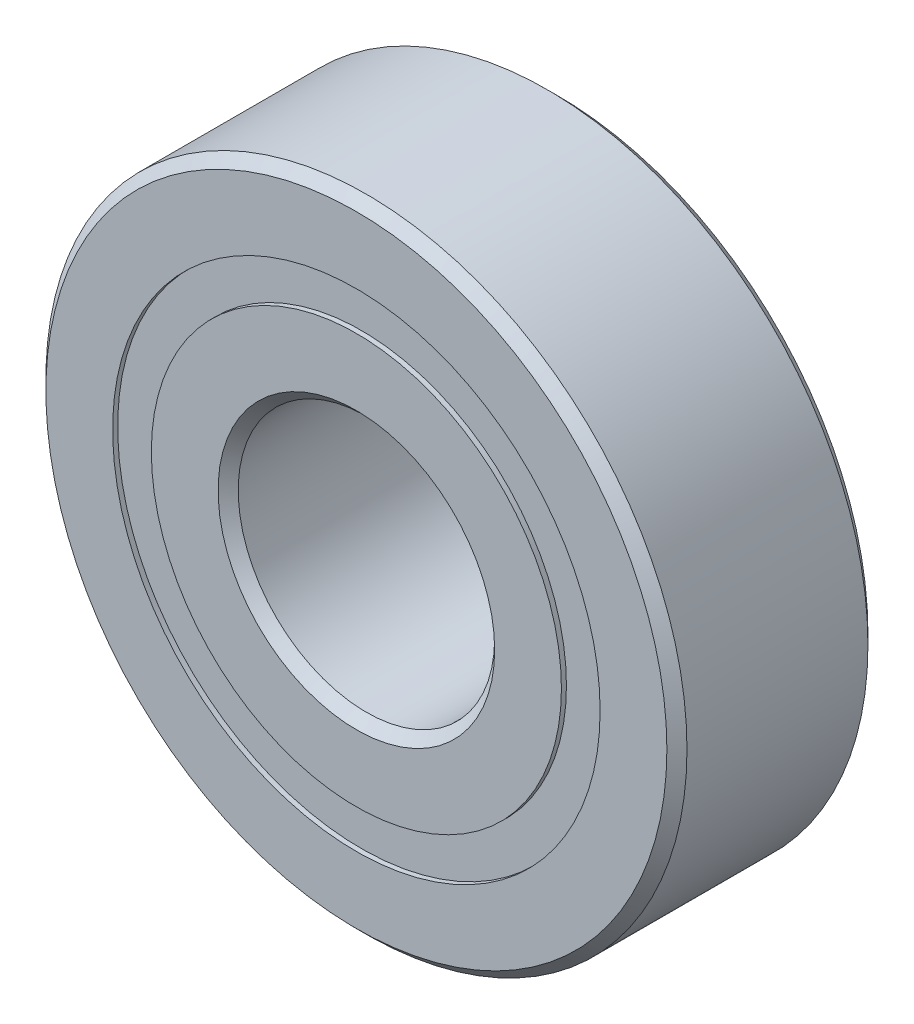
ISO-10303-21;
HEADER;
FILE_DESCRIPTION(('STEP AP214'),'2;1');
FILE_NAME('part.step','',(''),(''),'','','');
FILE_SCHEMA(('AUTOMOTIVE_DESIGN { 1 0 10303 214 1 1 1 1 }'));
ENDSEC;
DATA;
#1=APPLICATION_CONTEXT('core data for automotive mechanical design processes');
#2=APPLICATION_PROTOCOL_DEFINITION('international standard','automotive_design',2000,#1);
#3=PRODUCT_CONTEXT('',#1,'mechanical');
#4=PRODUCT('Part','Part','',(#3));
#5=PRODUCT_RELATED_PRODUCT_CATEGORY('part','',(#4));
#6=PRODUCT_DEFINITION_FORMATION('','',#4);
#7=PRODUCT_DEFINITION_CONTEXT('part definition',#1,'design');
#8=PRODUCT_DEFINITION('design','',#6,#7);
#9=PRODUCT_DEFINITION_SHAPE('','',#8);
#10=(LENGTH_UNIT() NAMED_UNIT(*) SI_UNIT(.MILLI.,.METRE.));
#11=(NAMED_UNIT(*) PLANE_ANGLE_UNIT() SI_UNIT($,.RADIAN.));
#12=(NAMED_UNIT(*) SI_UNIT($,.STERADIAN.) SOLID_ANGLE_UNIT());
#13=UNCERTAINTY_MEASURE_WITH_UNIT(LENGTH_MEASURE(1.E-05),#10,'distance_accuracy_value','');
#14=(GEOMETRIC_REPRESENTATION_CONTEXT(3) GLOBAL_UNCERTAINTY_ASSIGNED_CONTEXT((#13)) GLOBAL_UNIT_ASSIGNED_CONTEXT((#10,
#11,#12)) REPRESENTATION_CONTEXT('',''));
#15=CARTESIAN_POINT('',(0.,0.,0.));
#16=DIRECTION('',(0.,0.,1.));
#17=DIRECTION('',(1.,0.,0.));
#18=AXIS2_PLACEMENT_3D('',#15,#16,#17);
#19=CARTESIAN_POINT('',(0.,6.03522142857143,-2.36474));
#20=DIRECTION('',(0.,0.,1.));
#21=DIRECTION('',(1.,0.,0.));
#22=AXIS2_PLACEMENT_3D('',#19,#20,#21);
#23=PLANE('',#22);
#24=CARTESIAN_POINT('',(0.,0.,-2.36474));
#25=DIRECTION('',(0.,0.,1.));
#26=DIRECTION('',(1.,0.,0.));
#27=AXIS2_PLACEMENT_3D('',#24,#25,#26);
#28=CIRCLE('',#27,6.03522142857143);
#29=CARTESIAN_POINT('',(6.03522142857143,0.,-2.36474));
#30=VERTEX_POINT('',#29);
#31=EDGE_CURVE('E55',#30,#30,#28,.T.);
#32=ORIENTED_EDGE('',*,*,#31,.F.);
#33=EDGE_LOOP('',(#32));
#34=FACE_BOUND('',#33,.T.);
#35=CARTESIAN_POINT('',(0.,0.,-2.36474));
#36=DIRECTION('',(0.,0.,1.));
#37=DIRECTION('',(1.,0.,0.));
#38=AXIS2_PLACEMENT_3D('',#35,#36,#37);
#39=CIRCLE('',#38,5.07727857142857);
#40=CARTESIAN_POINT('',(5.07727857142857,0.,-2.36474));
#41=VERTEX_POINT('',#40);
#42=EDGE_CURVE('E11',#41,#41,#39,.T.);
#43=ORIENTED_EDGE('',*,*,#42,.T.);
#44=EDGE_LOOP('',(#43));
#45=FACE_BOUND('',#44,.T.);
#46=ADVANCED_FACE('F41',(#34,#45),#23,.F.);
#47=CARTESIAN_POINT('',(0.,0.,2.4892));
#48=DIRECTION('',(0.,0.,1.));
#49=DIRECTION('',(1.,0.,0.));
#50=AXIS2_PLACEMENT_3D('',#47,#48,#49);
#51=CYLINDRICAL_SURFACE('',#50,5.07727857142857);
#52=ORIENTED_EDGE('',*,*,#42,.F.);
#53=EDGE_LOOP('',(#52));
#54=FACE_BOUND('',#53,.T.);
#55=CARTESIAN_POINT('',(0.,0.,-1.20554465033679));
#56=DIRECTION('',(0.,0.,1.));
#57=DIRECTION('',(1.,0.,0.));
#58=AXIS2_PLACEMENT_3D('',#55,#56,#57);
#59=CIRCLE('',#58,5.07727857142857);
#60=CARTESIAN_POINT('',(5.07727857142857,0.,-1.20554465033679));
#61=VERTEX_POINT('',#60);
#62=EDGE_CURVE('E47',#61,#61,#59,.T.);
#63=ORIENTED_EDGE('',*,*,#62,.T.);
#64=EDGE_LOOP('',(#63));
#65=FACE_BOUND('',#64,.T.);
#66=ADVANCED_FACE('F64',(#54,#65),#51,.F.);
#67=CARTESIAN_POINT('',(0.,6.03522142857143,-1.20554465033679));
#68=DIRECTION('',(0.,0.,-1.));
#69=DIRECTION('',(-1.,0.,0.));
#70=AXIS2_PLACEMENT_3D('',#67,#68,#69);
#71=PLANE('',#70);
#72=ORIENTED_EDGE('',*,*,#62,.F.);
#73=EDGE_LOOP('',(#72));
#74=FACE_BOUND('',#73,.T.);
#75=CARTESIAN_POINT('',(0.,0.,-1.20554465033679));
#76=DIRECTION('',(0.,0.,1.));
#77=DIRECTION('',(1.,0.,0.));
#78=AXIS2_PLACEMENT_3D('',#75,#76,#77);
#79=CIRCLE('',#78,6.03522142857143);
#80=CARTESIAN_POINT('',(6.03522142857143,0.,-1.20554465033679));
#81=VERTEX_POINT('',#80);
#82=EDGE_CURVE('E51',#81,#81,#79,.T.);
#83=ORIENTED_EDGE('',*,*,#82,.T.);
#84=EDGE_LOOP('',(#83));
#85=FACE_BOUND('',#84,.T.);
#86=ADVANCED_FACE('F68',(#74,#85),#71,.F.);
#87=CARTESIAN_POINT('',(0.,0.,2.4892));
#88=DIRECTION('',(0.,0.,1.));
#89=DIRECTION('',(1.,0.,0.));
#90=AXIS2_PLACEMENT_3D('',#87,#88,#89);
#91=CYLINDRICAL_SURFACE('',#90,6.03522142857143);
#92=ORIENTED_EDGE('',*,*,#82,.F.);
#93=EDGE_LOOP('',(#92));
#94=FACE_BOUND('',#93,.T.);
#95=ORIENTED_EDGE('',*,*,#31,.T.);
#96=EDGE_LOOP('',(#95));
#97=FACE_BOUND('',#96,.T.);
#98=ADVANCED_FACE('F61',(#94,#97),#91,.T.);
#99=CLOSED_SHELL('',(#46,#66,#86,#98));
#100=MANIFOLD_SOLID_BREP('B2',#99);
#101=CARTESIAN_POINT('',(0.,6.03522142857143,2.36474));
#102=DIRECTION('',(0.,0.,-1.));
#103=DIRECTION('',(-1.,0.,0.));
#104=AXIS2_PLACEMENT_3D('',#101,#102,#103);
#105=PLANE('',#104);
#106=CARTESIAN_POINT('',(0.,0.,2.36474));
#107=DIRECTION('',(0.,0.,1.));
#108=DIRECTION('',(1.,0.,0.));
#109=AXIS2_PLACEMENT_3D('',#106,#107,#108);
#110=CIRCLE('',#109,5.07727857142857);
#111=CARTESIAN_POINT('',(5.07727857142857,0.,2.36474));
#112=VERTEX_POINT('',#111);
#113=EDGE_CURVE('E40',#112,#112,#110,.T.);
#114=ORIENTED_EDGE('',*,*,#113,.F.);
#115=EDGE_LOOP('',(#114));
#116=FACE_BOUND('',#115,.T.);
#117=CARTESIAN_POINT('',(0.,0.,2.36474));
#118=DIRECTION('',(0.,0.,1.));
#119=DIRECTION('',(1.,0.,0.));
#120=AXIS2_PLACEMENT_3D('',#117,#118,#119);
#121=CIRCLE('',#120,6.03522142857143);
#122=CARTESIAN_POINT('',(6.03522142857143,0.,2.36474));
#123=VERTEX_POINT('',#122);
#124=EDGE_CURVE('E122',#123,#123,#121,.T.);
#125=ORIENTED_EDGE('',*,*,#124,.T.);
#126=EDGE_LOOP('',(#125));
#127=FACE_BOUND('',#126,.T.);
#128=ADVANCED_FACE('F108',(#116,#127),#105,.F.);
#129=CARTESIAN_POINT('',(0.,0.,2.4892));
#130=DIRECTION('',(0.,0.,1.));
#131=DIRECTION('',(1.,0.,0.));
#132=AXIS2_PLACEMENT_3D('',#129,#130,#131);
#133=CYLINDRICAL_SURFACE('',#132,5.07727857142857);
#134=CARTESIAN_POINT('',(0.,0.,1.20554465033679));
#135=DIRECTION('',(0.,0.,1.));
#136=DIRECTION('',(1.,0.,0.));
#137=AXIS2_PLACEMENT_3D('',#134,#135,#136);
#138=CIRCLE('',#137,5.07727857142857);
#139=CARTESIAN_POINT('',(5.07727857142857,0.,1.20554465033679));
#140=VERTEX_POINT('',#139);
#141=EDGE_CURVE('E114',#140,#140,#138,.T.);
#142=ORIENTED_EDGE('',*,*,#141,.F.);
#143=EDGE_LOOP('',(#142));
#144=FACE_BOUND('',#143,.T.);
#145=ORIENTED_EDGE('',*,*,#113,.T.);
#146=EDGE_LOOP('',(#145));
#147=FACE_BOUND('',#146,.T.);
#148=ADVANCED_FACE('F137',(#144,#147),#133,.F.);
#149=CARTESIAN_POINT('',(0.,6.03522142857143,1.20554465033679));
#150=DIRECTION('',(0.,0.,1.));
#151=DIRECTION('',(1.,0.,0.));
#152=AXIS2_PLACEMENT_3D('',#149,#150,#151);
#153=PLANE('',#152);
#154=CARTESIAN_POINT('',(0.,0.,1.20554465033679));
#155=DIRECTION('',(0.,0.,1.));
#156=DIRECTION('',(1.,0.,0.));
#157=AXIS2_PLACEMENT_3D('',#154,#155,#156);
#158=CIRCLE('',#157,6.03522142857143);
#159=CARTESIAN_POINT('',(6.03522142857143,0.,1.20554465033679));
#160=VERTEX_POINT('',#159);
#161=EDGE_CURVE('E118',#160,#160,#158,.T.);
#162=ORIENTED_EDGE('',*,*,#161,.F.);
#163=EDGE_LOOP('',(#162));
#164=FACE_BOUND('',#163,.T.);
#165=ORIENTED_EDGE('',*,*,#141,.T.);
#166=EDGE_LOOP('',(#165));
#167=FACE_BOUND('',#166,.T.);
#168=ADVANCED_FACE('F132',(#164,#167),#153,.F.);
#169=CARTESIAN_POINT('',(0.,0.,2.4892));
#170=DIRECTION('',(0.,0.,1.));
#171=DIRECTION('',(1.,0.,0.));
#172=AXIS2_PLACEMENT_3D('',#169,#170,#171);
#173=CYLINDRICAL_SURFACE('',#172,6.03522142857143);
#174=ORIENTED_EDGE('',*,*,#124,.F.);
#175=EDGE_LOOP('',(#174));
#176=FACE_BOUND('',#175,.T.);
#177=ORIENTED_EDGE('',*,*,#161,.T.);
#178=EDGE_LOOP('',(#177));
#179=FACE_BOUND('',#178,.T.);
#180=ADVANCED_FACE('F129',(#176,#179),#173,.T.);
#181=CLOSED_SHELL('',(#128,#148,#168,#180));
#182=MANIFOLD_SOLID_BREP('B6',#181);
#183=CARTESIAN_POINT('',(-3.92886205296771,3.9288620529678,0.));
#184=DIRECTION('',(0.,0.,1.));
#185=DIRECTION('',(-0.707106781186539,0.707106781186556,0.));
#186=AXIS2_PLACEMENT_3D('',#183,#184,#185);
#187=SPHERICAL_SURFACE('',#186,1.20554465033679);
#188=CARTESIAN_POINT('',(-3.92886205296771,3.9288620529678,1.20554465033679));
#189=VERTEX_POINT('',#188);
#190=VERTEX_LOOP('',#189);
#191=FACE_BOUND('',#190,.T.);
#192=ADVANCED_FACE('F175',(#191),#187,.T.);
#193=CLOSED_SHELL('',(#192));
#194=MANIFOLD_SOLID_BREP('B35',#193);
#195=CARTESIAN_POINT('',(-5.55625,0.,0.));
#196=DIRECTION('',(0.,0.,1.));
#197=DIRECTION('',(-1.,0.,0.));
#198=AXIS2_PLACEMENT_3D('',#195,#196,#197);
#199=SPHERICAL_SURFACE('',#198,1.20554465033679);
#200=CARTESIAN_POINT('',(-5.55625,0.,1.20554465033679));
#201=VERTEX_POINT('',#200);
#202=VERTEX_LOOP('',#201);
#203=FACE_BOUND('',#202,.T.);
#204=ADVANCED_FACE('F195',(#203),#199,.T.);
#205=CLOSED_SHELL('',(#204));
#206=MANIFOLD_SOLID_BREP('B104',#205);
#207=CARTESIAN_POINT('',(-3.92886205296779,-3.92886205296772,0.));
#208=DIRECTION('',(0.,0.,1.));
#209=DIRECTION('',(-0.707106781186554,-0.707106781186541,0.));
#210=AXIS2_PLACEMENT_3D('',#207,#208,#209);
#211=SPHERICAL_SURFACE('',#210,1.20554465033679);
#212=CARTESIAN_POINT('',(-3.92886205296779,-3.92886205296772,1.20554465033679));
#213=VERTEX_POINT('',#212);
#214=VERTEX_LOOP('',#213);
#215=FACE_BOUND('',#214,.T.);
#216=ADVANCED_FACE('F215',(#215),#211,.T.);
#217=CLOSED_SHELL('',(#216));
#218=MANIFOLD_SOLID_BREP('B171',#217);
#219=CARTESIAN_POINT('',(0.,-5.55625,0.));
#220=DIRECTION('',(0.,0.,1.));
#221=DIRECTION('',(0.,-1.,0.));
#222=AXIS2_PLACEMENT_3D('',#219,#220,#221);
#223=SPHERICAL_SURFACE('',#222,1.20554465033679);
#224=CARTESIAN_POINT('',(0.,-5.55625,1.20554465033679));
#225=VERTEX_POINT('',#224);
#226=VERTEX_LOOP('',#225);
#227=FACE_BOUND('',#226,.T.);
#228=ADVANCED_FACE('F235',(#227),#223,.T.);
#229=CLOSED_SHELL('',(#228));
#230=MANIFOLD_SOLID_BREP('B191',#229);
#231=CARTESIAN_POINT('',(3.92886205296773,-3.92886205296778,0.));
#232=DIRECTION('',(0.,0.,1.));
#233=DIRECTION('',(0.707106781186544,-0.707106781186551,0.));
#234=AXIS2_PLACEMENT_3D('',#231,#232,#233);
#235=SPHERICAL_SURFACE('',#234,1.20554465033679);
#236=CARTESIAN_POINT('',(3.92886205296773,-3.92886205296778,1.20554465033679));
#237=VERTEX_POINT('',#236);
#238=VERTEX_LOOP('',#237);
#239=FACE_BOUND('',#238,.T.);
#240=ADVANCED_FACE('F255',(#239),#235,.T.);
#241=CLOSED_SHELL('',(#240));
#242=MANIFOLD_SOLID_BREP('B211',#241);
#243=CARTESIAN_POINT('',(5.55625,0.,0.));
#244=DIRECTION('',(0.,0.,1.));
#245=DIRECTION('',(1.,0.,0.));
#246=AXIS2_PLACEMENT_3D('',#243,#244,#245);
#247=SPHERICAL_SURFACE('',#246,1.20554465033679);
#248=CARTESIAN_POINT('',(5.55625,0.,1.20554465033679));
#249=VERTEX_POINT('',#248);
#250=VERTEX_LOOP('',#249);
#251=FACE_BOUND('',#250,.T.);
#252=ADVANCED_FACE('F275',(#251),#247,.T.);
#253=CLOSED_SHELL('',(#252));
#254=MANIFOLD_SOLID_BREP('B231',#253);
#255=CARTESIAN_POINT('',(3.92886205296776,3.92886205296775,0.));
#256=DIRECTION('',(0.,0.,1.));
#257=DIRECTION('',(0.707106781186549,0.707106781186546,0.));
#258=AXIS2_PLACEMENT_3D('',#255,#256,#257);
#259=SPHERICAL_SURFACE('',#258,1.20554465033679);
#260=CARTESIAN_POINT('',(3.92886205296776,3.92886205296775,1.20554465033679));
#261=VERTEX_POINT('',#260);
#262=VERTEX_LOOP('',#261);
#263=FACE_BOUND('',#262,.T.);
#264=ADVANCED_FACE('F295',(#263),#259,.T.);
#265=CLOSED_SHELL('',(#264));
#266=MANIFOLD_SOLID_BREP('B251',#265);
#267=CARTESIAN_POINT('',(0.,5.55625,0.));
#268=DIRECTION('',(0.,0.,1.));
#269=DIRECTION('',(0.,1.,0.));
#270=AXIS2_PLACEMENT_3D('',#267,#268,#269);
#271=SPHERICAL_SURFACE('',#270,1.20554465033679);
#272=CARTESIAN_POINT('',(0.,5.55625,1.20554465033679));
#273=VERTEX_POINT('',#272);
#274=VERTEX_LOOP('',#273);
#275=FACE_BOUND('',#274,.T.);
#276=ADVANCED_FACE('F317',(#275),#271,.T.);
#277=CLOSED_SHELL('',(#276));
#278=MANIFOLD_SOLID_BREP('B271',#277);
#279=CARTESIAN_POINT('',(0.,5.07727857142857,2.4892));
#280=DIRECTION('',(0.,0.,-1.));
#281=DIRECTION('',(-1.,0.,0.));
#282=AXIS2_PLACEMENT_3D('',#279,#280,#281);
#283=PLANE('',#282);
#284=CARTESIAN_POINT('',(0.,0.,2.4892));
#285=DIRECTION('',(0.,0.,1.));
#286=DIRECTION('',(1.,0.,0.));
#287=AXIS2_PLACEMENT_3D('',#284,#285,#286);
#288=CIRCLE('',#287,3.42392);
#289=CARTESIAN_POINT('',(3.42392,0.,2.4892));
#290=VERTEX_POINT('',#289);
#291=EDGE_CURVE('E364',#290,#290,#288,.T.);
#292=ORIENTED_EDGE('',*,*,#291,.F.);
#293=EDGE_LOOP('',(#292));
#294=FACE_BOUND('',#293,.T.);
#295=CARTESIAN_POINT('',(0.,0.,2.4892));
#296=DIRECTION('',(0.,0.,1.));
#297=DIRECTION('',(1.,0.,0.));
#298=AXIS2_PLACEMENT_3D('',#295,#296,#297);
#299=CIRCLE('',#298,5.07727857142857);
#300=CARTESIAN_POINT('',(5.07727857142857,0.,2.4892));
#301=VERTEX_POINT('',#300);
#302=EDGE_CURVE('E316',#301,#301,#299,.T.);
#303=ORIENTED_EDGE('',*,*,#302,.T.);
#304=EDGE_LOOP('',(#303));
#305=FACE_BOUND('',#304,.T.);
#306=ADVANCED_FACE('F336',(#294,#305),#283,.F.);
#307=CARTESIAN_POINT('',(0.,0.,2.4892));
#308=DIRECTION('',(0.,0.,1.));
#309=DIRECTION('',(1.,0.,0.));
#310=AXIS2_PLACEMENT_3D('',#307,#308,#309);
#311=CYLINDRICAL_SURFACE('',#310,5.07727857142857);
#312=ORIENTED_EDGE('',*,*,#302,.F.);
#313=EDGE_LOOP('',(#312));
#314=FACE_BOUND('',#313,.T.);
#315=CARTESIAN_POINT('',(0.,0.,1.10631111111111));
#316=DIRECTION('',(0.,0.,1.));
#317=DIRECTION('',(1.,0.,0.));
#318=AXIS2_PLACEMENT_3D('',#315,#316,#317);
#319=CIRCLE('',#318,5.07727857142857);
#320=CARTESIAN_POINT('',(5.07727857142857,0.,1.10631111111111));
#321=VERTEX_POINT('',#320);
#322=EDGE_CURVE('E342',#321,#321,#319,.T.);
#323=ORIENTED_EDGE('',*,*,#322,.T.);
#324=EDGE_LOOP('',(#323));
#325=FACE_BOUND('',#324,.T.);
#326=ADVANCED_FACE('F371',(#314,#325),#311,.T.);
#327=CARTESIAN_POINT('',(0.,0.,0.));
#328=DIRECTION('',(0.,0.,1.));
#329=DIRECTION('',(1.,0.,0.));
#330=AXIS2_PLACEMENT_3D('',#327,#328,#329);
#331=TOROIDAL_SURFACE('',#330,5.55625,1.20554465033679);
#332=ORIENTED_EDGE('',*,*,#322,.F.);
#333=EDGE_LOOP('',(#332));
#334=FACE_BOUND('',#333,.T.);
#335=CARTESIAN_POINT('',(0.,0.,-1.10631111111111));
#336=DIRECTION('',(0.,0.,1.));
#337=DIRECTION('',(1.,0.,0.));
#338=AXIS2_PLACEMENT_3D('',#335,#336,#337);
#339=CIRCLE('',#338,5.07727857142857);
#340=CARTESIAN_POINT('',(5.07727857142857,0.,-1.10631111111111));
#341=VERTEX_POINT('',#340);
#342=EDGE_CURVE('E346',#341,#341,#339,.T.);
#343=ORIENTED_EDGE('',*,*,#342,.T.);
#344=EDGE_LOOP('',(#343));
#345=FACE_BOUND('',#344,.T.);
#346=ADVANCED_FACE('F375',(#334,#345),#331,.F.);
#347=CARTESIAN_POINT('',(0.,0.,2.4892));
#348=DIRECTION('',(0.,0.,1.));
#349=DIRECTION('',(1.,0.,0.));
#350=AXIS2_PLACEMENT_3D('',#347,#348,#349);
#351=CYLINDRICAL_SURFACE('',#350,5.07727857142857);
#352=ORIENTED_EDGE('',*,*,#342,.F.);
#353=EDGE_LOOP('',(#352));
#354=FACE_BOUND('',#353,.T.);
#355=CARTESIAN_POINT('',(0.,0.,-2.4892));
#356=DIRECTION('',(0.,0.,1.));
#357=DIRECTION('',(1.,0.,0.));
#358=AXIS2_PLACEMENT_3D('',#355,#356,#357);
#359=CIRCLE('',#358,5.07727857142857);
#360=CARTESIAN_POINT('',(5.07727857142857,0.,-2.4892));
#361=VERTEX_POINT('',#360);
#362=EDGE_CURVE('E350',#361,#361,#359,.T.);
#363=ORIENTED_EDGE('',*,*,#362,.T.);
#364=EDGE_LOOP('',(#363));
#365=FACE_BOUND('',#364,.T.);
#366=ADVANCED_FACE('F380',(#354,#365),#351,.T.);
#367=CARTESIAN_POINT('',(0.,3.42392,-2.4892));
#368=DIRECTION('',(0.,0.,1.));
#369=DIRECTION('',(1.,0.,0.));
#370=AXIS2_PLACEMENT_3D('',#367,#368,#369);
#371=PLANE('',#370);
#372=ORIENTED_EDGE('',*,*,#362,.F.);
#373=EDGE_LOOP('',(#372));
#374=FACE_BOUND('',#373,.T.);
#375=CARTESIAN_POINT('',(0.,0.,-2.4892));
#376=DIRECTION('',(0.,0.,1.));
#377=DIRECTION('',(1.,0.,0.));
#378=AXIS2_PLACEMENT_3D('',#375,#376,#377);
#379=CIRCLE('',#378,3.42392);
#380=CARTESIAN_POINT('',(3.42392,0.,-2.4892));
#381=VERTEX_POINT('',#380);
#382=EDGE_CURVE('E355',#381,#381,#379,.T.);
#383=ORIENTED_EDGE('',*,*,#382,.T.);
#384=EDGE_LOOP('',(#383));
#385=FACE_BOUND('',#384,.T.);
#386=ADVANCED_FACE('F386',(#374,#385),#371,.F.);
#387=CARTESIAN_POINT('',(0.,0.,-2.24028));
#388=DIRECTION('',(0.,0.,-1.));
#389=DIRECTION('',(-1.,0.,0.));
#390=AXIS2_PLACEMENT_3D('',#387,#388,#389);
#391=CONICAL_SURFACE('',#390,3.175,0.78539816339744);
#392=ORIENTED_EDGE('',*,*,#382,.F.);
#393=EDGE_LOOP('',(#392));
#394=FACE_BOUND('',#393,.T.);
#395=CARTESIAN_POINT('',(0.,0.,-2.24028));
#396=DIRECTION('',(0.,0.,1.));
#397=DIRECTION('',(1.,0.,0.));
#398=AXIS2_PLACEMENT_3D('',#395,#396,#397);
#399=CIRCLE('',#398,3.175);
#400=CARTESIAN_POINT('',(3.175,0.,-2.24028));
#401=VERTEX_POINT('',#400);
#402=EDGE_CURVE('E358',#401,#401,#399,.T.);
#403=ORIENTED_EDGE('',*,*,#402,.T.);
#404=EDGE_LOOP('',(#403));
#405=FACE_BOUND('',#404,.T.);
#406=ADVANCED_FACE('F390',(#394,#405),#391,.F.);
#407=CARTESIAN_POINT('',(0.,0.,2.4892));
#408=DIRECTION('',(0.,0.,1.));
#409=DIRECTION('',(1.,0.,0.));
#410=AXIS2_PLACEMENT_3D('',#407,#408,#409);
#411=CYLINDRICAL_SURFACE('',#410,3.175);
#412=ORIENTED_EDGE('',*,*,#402,.F.);
#413=EDGE_LOOP('',(#412));
#414=FACE_BOUND('',#413,.T.);
#415=CARTESIAN_POINT('',(0.,0.,2.24028));
#416=DIRECTION('',(0.,0.,1.));
#417=DIRECTION('',(1.,0.,0.));
#418=AXIS2_PLACEMENT_3D('',#415,#416,#417);
#419=CIRCLE('',#418,3.175);
#420=CARTESIAN_POINT('',(3.175,0.,2.24028));
#421=VERTEX_POINT('',#420);
#422=EDGE_CURVE('E361',#421,#421,#419,.T.);
#423=ORIENTED_EDGE('',*,*,#422,.T.);
#424=EDGE_LOOP('',(#423));
#425=FACE_BOUND('',#424,.T.);
#426=ADVANCED_FACE('F394',(#414,#425),#411,.F.);
#427=CARTESIAN_POINT('',(0.,0.,2.4892));
#428=DIRECTION('',(0.,0.,1.));
#429=DIRECTION('',(1.,0.,0.));
#430=AXIS2_PLACEMENT_3D('',#427,#428,#429);
#431=CONICAL_SURFACE('',#430,3.42392,0.785398163397456);
#432=ORIENTED_EDGE('',*,*,#422,.F.);
#433=EDGE_LOOP('',(#432));
#434=FACE_BOUND('',#433,.T.);
#435=ORIENTED_EDGE('',*,*,#291,.T.);
#436=EDGE_LOOP('',(#435));
#437=FACE_BOUND('',#436,.T.);
#438=ADVANCED_FACE('F368',(#434,#437),#431,.F.);
#439=CLOSED_SHELL('',(#306,#326,#346,#366,#386,#406,#426,#438));
#440=MANIFOLD_SOLID_BREP('B291',#439);
#441=CARTESIAN_POINT('',(0.,0.,2.24028));
#442=DIRECTION('',(0.,0.,-1.));
#443=DIRECTION('',(-1.,0.,0.));
#444=AXIS2_PLACEMENT_3D('',#441,#442,#443);
#445=CONICAL_SURFACE('',#444,7.9375,0.785398163397445);
#446=CARTESIAN_POINT('',(0.,0.,2.4892));
#447=DIRECTION('',(0.,0.,1.));
#448=DIRECTION('',(1.,0.,0.));
#449=AXIS2_PLACEMENT_3D('',#446,#447,#448);
#450=CIRCLE('',#449,7.68858);
#451=CARTESIAN_POINT('',(7.68858,0.,2.4892));
#452=VERTEX_POINT('',#451);
#453=EDGE_CURVE('E485',#452,#452,#450,.T.);
#454=ORIENTED_EDGE('',*,*,#453,.F.);
#455=EDGE_LOOP('',(#454));
#456=FACE_BOUND('',#455,.T.);
#457=CARTESIAN_POINT('',(0.,0.,2.24028));
#458=DIRECTION('',(0.,0.,1.));
#459=DIRECTION('',(1.,0.,0.));
#460=AXIS2_PLACEMENT_3D('',#457,#458,#459);
#461=CIRCLE('',#460,7.9375);
#462=CARTESIAN_POINT('',(7.9375,0.,2.24028));
#463=VERTEX_POINT('',#462);
#464=EDGE_CURVE('E335',#463,#463,#461,.T.);
#465=ORIENTED_EDGE('',*,*,#464,.T.);
#466=EDGE_LOOP('',(#465));
#467=FACE_BOUND('',#466,.T.);
#468=ADVANCED_FACE('F457',(#456,#467),#445,.T.);
#469=CARTESIAN_POINT('',(0.,0.,2.4892));
#470=DIRECTION('',(0.,0.,1.));
#471=DIRECTION('',(1.,0.,0.));
#472=AXIS2_PLACEMENT_3D('',#469,#470,#471);
#473=CYLINDRICAL_SURFACE('',#472,7.9375);
#474=ORIENTED_EDGE('',*,*,#464,.F.);
#475=EDGE_LOOP('',(#474));
#476=FACE_BOUND('',#475,.T.);
#477=CARTESIAN_POINT('',(0.,0.,-2.24028));
#478=DIRECTION('',(0.,0.,1.));
#479=DIRECTION('',(1.,0.,0.));
#480=AXIS2_PLACEMENT_3D('',#477,#478,#479);
#481=CIRCLE('',#480,7.9375);
#482=CARTESIAN_POINT('',(7.9375,0.,-2.24028));
#483=VERTEX_POINT('',#482);
#484=EDGE_CURVE('E463',#483,#483,#481,.T.);
#485=ORIENTED_EDGE('',*,*,#484,.T.);
#486=EDGE_LOOP('',(#485));
#487=FACE_BOUND('',#486,.T.);
#488=ADVANCED_FACE('F492',(#476,#487),#473,.T.);
#489=CARTESIAN_POINT('',(0.,0.,-2.4892));
#490=DIRECTION('',(0.,0.,1.));
#491=DIRECTION('',(1.,0.,0.));
#492=AXIS2_PLACEMENT_3D('',#489,#490,#491);
#493=CONICAL_SURFACE('',#492,7.68858,0.785398163397443);
#494=ORIENTED_EDGE('',*,*,#484,.F.);
#495=EDGE_LOOP('',(#494));
#496=FACE_BOUND('',#495,.T.);
#497=CARTESIAN_POINT('',(0.,0.,-2.4892));
#498=DIRECTION('',(0.,0.,1.));
#499=DIRECTION('',(1.,0.,0.));
#500=AXIS2_PLACEMENT_3D('',#497,#498,#499);
#501=CIRCLE('',#500,7.68858);
#502=CARTESIAN_POINT('',(7.68858,0.,-2.4892));
#503=VERTEX_POINT('',#502);
#504=EDGE_CURVE('E467',#503,#503,#501,.T.);
#505=ORIENTED_EDGE('',*,*,#504,.T.);
#506=EDGE_LOOP('',(#505));
#507=FACE_BOUND('',#506,.T.);
#508=ADVANCED_FACE('F496',(#496,#507),#493,.T.);
#509=CARTESIAN_POINT('',(0.,7.68858,-2.4892));
#510=DIRECTION('',(0.,0.,1.));
#511=DIRECTION('',(1.,0.,0.));
#512=AXIS2_PLACEMENT_3D('',#509,#510,#511);
#513=PLANE('',#512);
#514=ORIENTED_EDGE('',*,*,#504,.F.);
#515=EDGE_LOOP('',(#514));
#516=FACE_BOUND('',#515,.T.);
#517=CARTESIAN_POINT('',(0.,0.,-2.4892));
#518=DIRECTION('',(0.,0.,1.));
#519=DIRECTION('',(1.,0.,0.));
#520=AXIS2_PLACEMENT_3D('',#517,#518,#519);
#521=CIRCLE('',#520,6.03522142857143);
#522=CARTESIAN_POINT('',(6.03522142857143,0.,-2.4892));
#523=VERTEX_POINT('',#522);
#524=EDGE_CURVE('E471',#523,#523,#521,.T.);
#525=ORIENTED_EDGE('',*,*,#524,.T.);
#526=EDGE_LOOP('',(#525));
#527=FACE_BOUND('',#526,.T.);
#528=ADVANCED_FACE('F501',(#516,#527),#513,.F.);
#529=CARTESIAN_POINT('',(0.,0.,2.4892));
#530=DIRECTION('',(0.,0.,1.));
#531=DIRECTION('',(1.,0.,0.));
#532=AXIS2_PLACEMENT_3D('',#529,#530,#531);
#533=CYLINDRICAL_SURFACE('',#532,6.03522142857143);
#534=ORIENTED_EDGE('',*,*,#524,.F.);
#535=EDGE_LOOP('',(#534));
#536=FACE_BOUND('',#535,.T.);
#537=CARTESIAN_POINT('',(0.,0.,-1.10631111111111));
#538=DIRECTION('',(0.,0.,1.));
#539=DIRECTION('',(1.,0.,0.));
#540=AXIS2_PLACEMENT_3D('',#537,#538,#539);
#541=CIRCLE('',#540,6.03522142857143);
#542=CARTESIAN_POINT('',(6.03522142857143,0.,-1.10631111111111));
#543=VERTEX_POINT('',#542);
#544=EDGE_CURVE('E476',#543,#543,#541,.T.);
#545=ORIENTED_EDGE('',*,*,#544,.T.);
#546=EDGE_LOOP('',(#545));
#547=FACE_BOUND('',#546,.T.);
#548=ADVANCED_FACE('F507',(#536,#547),#533,.F.);
#549=CARTESIAN_POINT('',(0.,0.,0.));
#550=DIRECTION('',(0.,0.,1.));
#551=DIRECTION('',(1.,0.,0.));
#552=AXIS2_PLACEMENT_3D('',#549,#550,#551);
#553=TOROIDAL_SURFACE('',#552,5.55625,1.20554465033679);
#554=ORIENTED_EDGE('',*,*,#544,.F.);
#555=EDGE_LOOP('',(#554));
#556=FACE_BOUND('',#555,.T.);
#557=CARTESIAN_POINT('',(0.,0.,1.10631111111111));
#558=DIRECTION('',(0.,0.,1.));
#559=DIRECTION('',(1.,0.,0.));
#560=AXIS2_PLACEMENT_3D('',#557,#558,#559);
#561=CIRCLE('',#560,6.03522142857143);
#562=CARTESIAN_POINT('',(6.03522142857143,0.,1.10631111111111));
#563=VERTEX_POINT('',#562);
#564=EDGE_CURVE('E479',#563,#563,#561,.T.);
#565=ORIENTED_EDGE('',*,*,#564,.T.);
#566=EDGE_LOOP('',(#565));
#567=FACE_BOUND('',#566,.T.);
#568=ADVANCED_FACE('F511',(#556,#567),#553,.F.);
#569=CARTESIAN_POINT('',(0.,0.,2.4892));
#570=DIRECTION('',(0.,0.,1.));
#571=DIRECTION('',(1.,0.,0.));
#572=AXIS2_PLACEMENT_3D('',#569,#570,#571);
#573=CYLINDRICAL_SURFACE('',#572,6.03522142857143);
#574=ORIENTED_EDGE('',*,*,#564,.F.);
#575=EDGE_LOOP('',(#574));
#576=FACE_BOUND('',#575,.T.);
#577=CARTESIAN_POINT('',(0.,0.,2.4892));
#578=DIRECTION('',(0.,0.,1.));
#579=DIRECTION('',(1.,0.,0.));
#580=AXIS2_PLACEMENT_3D('',#577,#578,#579);
#581=CIRCLE('',#580,6.03522142857143);
#582=CARTESIAN_POINT('',(6.03522142857143,0.,2.4892));
#583=VERTEX_POINT('',#582);
#584=EDGE_CURVE('E482',#583,#583,#581,.T.);
#585=ORIENTED_EDGE('',*,*,#584,.T.);
#586=EDGE_LOOP('',(#585));
#587=FACE_BOUND('',#586,.T.);
#588=ADVANCED_FACE('F515',(#576,#587),#573,.F.);
#589=CARTESIAN_POINT('',(0.,7.68858,2.4892));
#590=DIRECTION('',(0.,0.,-1.));
#591=DIRECTION('',(-1.,0.,0.));
#592=AXIS2_PLACEMENT_3D('',#589,#590,#591);
#593=PLANE('',#592);
#594=ORIENTED_EDGE('',*,*,#584,.F.);
#595=EDGE_LOOP('',(#594));
#596=FACE_BOUND('',#595,.T.);
#597=ORIENTED_EDGE('',*,*,#453,.T.);
#598=EDGE_LOOP('',(#597));
#599=FACE_BOUND('',#598,.T.);
#600=ADVANCED_FACE('F489',(#596,#599),#593,.F.);
#601=CLOSED_SHELL('',(#468,#488,#508,#528,#548,#568,#588,#600));
#602=MANIFOLD_SOLID_BREP('B311',#601);
#603=ADVANCED_BREP_SHAPE_REPRESENTATION('',(#18,#100,#182,#194,#206,#218,#230,#242,#254,#266,
#278,#440,#602),#14);
#604=SHAPE_DEFINITION_REPRESENTATION(#9,#603);
ENDSEC;
END-ISO-10303-21;
